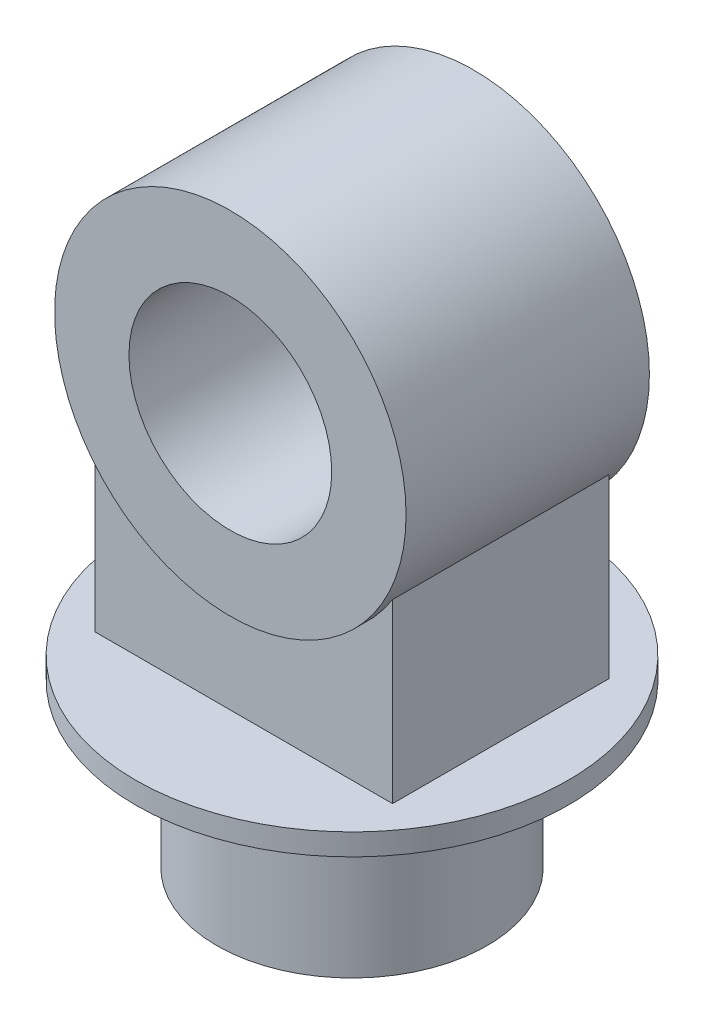
ISO-10303-21;
HEADER;
FILE_DESCRIPTION(('STEP AP214'),'2;1');
FILE_NAME('part.step','',(''),(''),'','','');
FILE_SCHEMA(('AUTOMOTIVE_DESIGN { 1 0 10303 214 1 1 1 1 }'));
ENDSEC;
DATA;
#1=APPLICATION_CONTEXT('core data for automotive mechanical design processes');
#2=APPLICATION_PROTOCOL_DEFINITION('international standard','automotive_design',2000,#1);
#3=PRODUCT_CONTEXT('',#1,'mechanical');
#4=PRODUCT('Part','Part','',(#3));
#5=PRODUCT_RELATED_PRODUCT_CATEGORY('part','',(#4));
#6=PRODUCT_DEFINITION_FORMATION('','',#4);
#7=PRODUCT_DEFINITION_CONTEXT('part definition',#1,'design');
#8=PRODUCT_DEFINITION('design','',#6,#7);
#9=PRODUCT_DEFINITION_SHAPE('','',#8);
#10=(LENGTH_UNIT() NAMED_UNIT(*) SI_UNIT(.MILLI.,.METRE.));
#11=(NAMED_UNIT(*) PLANE_ANGLE_UNIT() SI_UNIT($,.RADIAN.));
#12=(NAMED_UNIT(*) SI_UNIT($,.STERADIAN.) SOLID_ANGLE_UNIT());
#13=UNCERTAINTY_MEASURE_WITH_UNIT(LENGTH_MEASURE(1.E-05),#10,'distance_accuracy_value','');
#14=(GEOMETRIC_REPRESENTATION_CONTEXT(3) GLOBAL_UNCERTAINTY_ASSIGNED_CONTEXT((#13)) GLOBAL_UNIT_ASSIGNED_CONTEXT((#10,
#11,#12)) REPRESENTATION_CONTEXT('',''));
#15=CARTESIAN_POINT('',(0.,0.,0.));
#16=DIRECTION('',(0.,0.,1.));
#17=DIRECTION('',(1.,0.,0.));
#18=AXIS2_PLACEMENT_3D('',#15,#16,#17);
#19=CARTESIAN_POINT('',(0.,120.,0.));
#20=DIRECTION('',(0.,-1.,0.));
#21=DIRECTION('',(0.,0.,-1.));
#22=AXIS2_PLACEMENT_3D('',#19,#20,#21);
#23=CYLINDRICAL_SURFACE('',#22,100.);
#24=CARTESIAN_POINT('',(0.,120.,0.));
#25=DIRECTION('',(0.,1.,0.));
#26=DIRECTION('',(0.,0.,1.));
#27=AXIS2_PLACEMENT_3D('',#24,#25,#26);
#28=CIRCLE('',#27,100.);
#29=CARTESIAN_POINT('',(0.,120.,100.));
#30=VERTEX_POINT('',#29);
#31=EDGE_CURVE('E11',#30,#30,#28,.T.);
#32=ORIENTED_EDGE('',*,*,#31,.F.);
#33=EDGE_LOOP('',(#32));
#34=FACE_BOUND('',#33,.T.);
#35=CARTESIAN_POINT('',(0.,0.,0.));
#36=DIRECTION('',(0.,1.,0.));
#37=DIRECTION('',(0.,0.,1.));
#38=AXIS2_PLACEMENT_3D('',#35,#36,#37);
#39=CIRCLE('',#38,100.);
#40=CARTESIAN_POINT('',(0.,0.,100.));
#41=VERTEX_POINT('',#40);
#42=EDGE_CURVE('E46',#41,#41,#39,.T.);
#43=ORIENTED_EDGE('',*,*,#42,.T.);
#44=EDGE_LOOP('',(#43));
#45=FACE_BOUND('',#44,.T.);
#46=ADVANCED_FACE('F43',(#34,#45),#23,.T.);
#47=CARTESIAN_POINT('',(0.,0.,0.));
#48=DIRECTION('',(0.,1.,0.));
#49=DIRECTION('',(0.,0.,1.));
#50=AXIS2_PLACEMENT_3D('',#47,#48,#49);
#51=PLANE('',#50);
#52=ORIENTED_EDGE('',*,*,#42,.F.);
#53=EDGE_LOOP('',(#52));
#54=FACE_BOUND('',#53,.T.);
#55=ADVANCED_FACE('F163',(#54),#51,.F.);
#56=CARTESIAN_POINT('',(0.,136.,0.));
#57=DIRECTION('',(0.,-1.,0.));
#58=DIRECTION('',(0.,0.,-1.));
#59=AXIS2_PLACEMENT_3D('',#56,#57,#58);
#60=CYLINDRICAL_SURFACE('',#59,160.);
#61=CARTESIAN_POINT('',(0.,136.,0.));
#62=DIRECTION('',(0.,1.,0.));
#63=DIRECTION('',(0.,0.,1.));
#64=AXIS2_PLACEMENT_3D('',#61,#62,#63);
#65=CIRCLE('',#64,160.);
#66=CARTESIAN_POINT('',(0.,136.,160.));
#67=VERTEX_POINT('',#66);
#68=EDGE_CURVE('E110',#67,#67,#65,.T.);
#69=ORIENTED_EDGE('',*,*,#68,.F.);
#70=EDGE_LOOP('',(#69));
#71=FACE_BOUND('',#70,.T.);
#72=CARTESIAN_POINT('',(0.,120.,0.));
#73=DIRECTION('',(0.,1.,0.));
#74=DIRECTION('',(0.,0.,1.));
#75=AXIS2_PLACEMENT_3D('',#72,#73,#74);
#76=CIRCLE('',#75,160.);
#77=CARTESIAN_POINT('',(0.,120.,160.));
#78=VERTEX_POINT('',#77);
#79=EDGE_CURVE('E113',#78,#78,#76,.T.);
#80=ORIENTED_EDGE('',*,*,#79,.T.);
#81=EDGE_LOOP('',(#80));
#82=FACE_BOUND('',#81,.T.);
#83=ADVANCED_FACE('F168',(#71,#82),#60,.T.);
#84=CARTESIAN_POINT('',(0.,136.,0.));
#85=DIRECTION('',(0.,1.,0.));
#86=DIRECTION('',(0.,0.,1.));
#87=AXIS2_PLACEMENT_3D('',#84,#85,#86);
#88=PLANE('',#87);
#89=DIRECTION('',(0.,0.,-1.));
#90=VECTOR('',#89,1.);
#91=CARTESIAN_POINT('',(110.,136.,80.));
#92=LINE('',#91,#90);
#93=CARTESIAN_POINT('',(110.,136.,80.));
#94=VERTEX_POINT('',#93);
#95=CARTESIAN_POINT('',(110.,136.,-80.));
#96=VERTEX_POINT('',#95);
#97=EDGE_CURVE('E57',#94,#96,#92,.T.);
#98=ORIENTED_EDGE('',*,*,#97,.F.);
#99=DIRECTION('',(1.,0.,0.));
#100=VECTOR('',#99,1.);
#101=CARTESIAN_POINT('',(-110.,136.,80.));
#102=LINE('',#101,#100);
#103=CARTESIAN_POINT('',(-110.,136.,80.));
#104=VERTEX_POINT('',#103);
#105=EDGE_CURVE('E62',#104,#94,#102,.T.);
#106=ORIENTED_EDGE('',*,*,#105,.F.);
#107=DIRECTION('',(0.,0.,1.));
#108=VECTOR('',#107,1.);
#109=CARTESIAN_POINT('',(-110.,136.,80.));
#110=LINE('',#109,#108);
#111=CARTESIAN_POINT('',(-110.,136.,-80.));
#112=VERTEX_POINT('',#111);
#113=EDGE_CURVE('E120',#112,#104,#110,.T.);
#114=ORIENTED_EDGE('',*,*,#113,.F.);
#115=DIRECTION('',(-1.,0.,0.));
#116=VECTOR('',#115,1.);
#117=CARTESIAN_POINT('',(-110.,136.,-80.));
#118=LINE('',#117,#116);
#119=EDGE_CURVE('E117',#96,#112,#118,.T.);
#120=ORIENTED_EDGE('',*,*,#119,.F.);
#121=EDGE_LOOP('',(#98,#106,#114,#120));
#122=FACE_BOUND('',#121,.T.);
#123=ORIENTED_EDGE('',*,*,#68,.T.);
#124=EDGE_LOOP('',(#123));
#125=FACE_BOUND('',#124,.T.);
#126=ADVANCED_FACE('F178',(#122,#125),#88,.T.);
#127=CARTESIAN_POINT('',(0.,120.,0.));
#128=DIRECTION('',(0.,1.,0.));
#129=DIRECTION('',(0.,0.,1.));
#130=AXIS2_PLACEMENT_3D('',#127,#128,#129);
#131=PLANE('',#130);
#132=ORIENTED_EDGE('',*,*,#31,.T.);
#133=EDGE_LOOP('',(#132));
#134=FACE_BOUND('',#133,.T.);
#135=ORIENTED_EDGE('',*,*,#79,.F.);
#136=EDGE_LOOP('',(#135));
#137=FACE_BOUND('',#136,.T.);
#138=ADVANCED_FACE('F175',(#134,#137),#131,.F.);
#139=CARTESIAN_POINT('',(-110.,466.002,-80.));
#140=DIRECTION('',(0.,0.,1.));
#141=DIRECTION('',(1.,0.,0.));
#142=AXIS2_PLACEMENT_3D('',#139,#140,#141);
#143=PLANE('',#142);
#144=CARTESIAN_POINT('',(0.,336.,-80.));
#145=DIRECTION('',(0.,0.,1.));
#146=DIRECTION('',(1.,0.,0.));
#147=AXIS2_PLACEMENT_3D('',#144,#145,#146);
#148=CIRCLE('',#147,130.);
#149=CARTESIAN_POINT('',(110.,266.717967697245,-80.));
#150=VERTEX_POINT('',#149);
#151=CARTESIAN_POINT('',(-110.,266.717967697245,-80.));
#152=VERTEX_POINT('',#151);
#153=EDGE_CURVE('E97',#150,#152,#148,.F.);
#154=ORIENTED_EDGE('',*,*,#153,.F.);
#155=DIRECTION('',(0.,-1.,0.));
#156=VECTOR('',#155,1.);
#157=CARTESIAN_POINT('',(110.,466.002,-80.));
#158=LINE('',#157,#156);
#159=EDGE_CURVE('E94',#150,#96,#158,.T.);
#160=ORIENTED_EDGE('',*,*,#159,.T.);
#161=ORIENTED_EDGE('',*,*,#119,.T.);
#162=DIRECTION('',(0.,-1.,0.));
#163=VECTOR('',#162,1.);
#164=CARTESIAN_POINT('',(-110.,466.002,-80.));
#165=LINE('',#164,#163);
#166=EDGE_CURVE('E126',#152,#112,#165,.T.);
#167=ORIENTED_EDGE('',*,*,#166,.F.);
#168=EDGE_LOOP('',(#154,#160,#161,#167));
#169=FACE_BOUND('',#168,.T.);
#170=ADVANCED_FACE('F131',(#169),#143,.F.);
#171=CARTESIAN_POINT('',(110.,466.002,80.));
#172=DIRECTION('',(-1.,0.,0.));
#173=DIRECTION('',(0.,0.,1.));
#174=AXIS2_PLACEMENT_3D('',#171,#172,#173);
#175=PLANE('',#174);
#176=DIRECTION('',(0.,0.,-1.));
#177=VECTOR('',#176,1.);
#178=CARTESIAN_POINT('',(110.,266.717967697245,90.));
#179=LINE('',#178,#177);
#180=CARTESIAN_POINT('',(110.,266.717967697245,80.));
#181=VERTEX_POINT('',#180);
#182=EDGE_CURVE('E91',#181,#150,#179,.T.);
#183=ORIENTED_EDGE('',*,*,#182,.F.);
#184=DIRECTION('',(0.,-1.,0.));
#185=VECTOR('',#184,1.);
#186=CARTESIAN_POINT('',(110.,466.002,80.));
#187=LINE('',#186,#185);
#188=EDGE_CURVE('E80',#181,#94,#187,.T.);
#189=ORIENTED_EDGE('',*,*,#188,.T.);
#190=ORIENTED_EDGE('',*,*,#97,.T.);
#191=ORIENTED_EDGE('',*,*,#159,.F.);
#192=EDGE_LOOP('',(#183,#189,#190,#191));
#193=FACE_BOUND('',#192,.T.);
#194=ADVANCED_FACE('F92',(#193),#175,.F.);
#195=CARTESIAN_POINT('',(-110.,466.002,80.));
#196=DIRECTION('',(1.,0.,0.));
#197=DIRECTION('',(0.,0.,-1.));
#198=AXIS2_PLACEMENT_3D('',#195,#196,#197);
#199=PLANE('',#198);
#200=DIRECTION('',(0.,0.,-1.));
#201=VECTOR('',#200,1.);
#202=CARTESIAN_POINT('',(-110.,266.717967697245,90.));
#203=LINE('',#202,#201);
#204=CARTESIAN_POINT('',(-110.,266.717967697245,80.));
#205=VERTEX_POINT('',#204);
#206=EDGE_CURVE('E101',#152,#205,#203,.F.);
#207=ORIENTED_EDGE('',*,*,#206,.F.);
#208=ORIENTED_EDGE('',*,*,#166,.T.);
#209=ORIENTED_EDGE('',*,*,#113,.T.);
#210=DIRECTION('',(0.,-1.,0.));
#211=VECTOR('',#210,1.);
#212=CARTESIAN_POINT('',(-110.,466.002,80.));
#213=LINE('',#212,#211);
#214=EDGE_CURVE('E87',#205,#104,#213,.T.);
#215=ORIENTED_EDGE('',*,*,#214,.F.);
#216=EDGE_LOOP('',(#207,#208,#209,#215));
#217=FACE_BOUND('',#216,.T.);
#218=ADVANCED_FACE('F134',(#217),#199,.F.);
#219=CARTESIAN_POINT('',(-110.,466.002,80.));
#220=DIRECTION('',(0.,0.,-1.));
#221=DIRECTION('',(-1.,0.,0.));
#222=AXIS2_PLACEMENT_3D('',#219,#220,#221);
#223=PLANE('',#222);
#224=CARTESIAN_POINT('',(0.,336.,80.));
#225=DIRECTION('',(0.,0.,-1.));
#226=DIRECTION('',(-1.,0.,0.));
#227=AXIS2_PLACEMENT_3D('',#224,#225,#226);
#228=CIRCLE('',#227,130.);
#229=EDGE_CURVE('E84',#205,#181,#228,.F.);
#230=ORIENTED_EDGE('',*,*,#229,.F.);
#231=ORIENTED_EDGE('',*,*,#214,.T.);
#232=ORIENTED_EDGE('',*,*,#105,.T.);
#233=ORIENTED_EDGE('',*,*,#188,.F.);
#234=EDGE_LOOP('',(#230,#231,#232,#233));
#235=FACE_BOUND('',#234,.T.);
#236=ADVANCED_FACE('F82',(#235),#223,.F.);
#237=CARTESIAN_POINT('',(0.,336.,90.));
#238=DIRECTION('',(0.,0.,-1.));
#239=DIRECTION('',(-1.,0.,0.));
#240=AXIS2_PLACEMENT_3D('',#237,#238,#239);
#241=CYLINDRICAL_SURFACE('',#240,130.);
#242=CARTESIAN_POINT('',(0.,336.,90.));
#243=DIRECTION('',(0.,0.,1.));
#244=DIRECTION('',(1.,0.,0.));
#245=AXIS2_PLACEMENT_3D('',#242,#243,#244);
#246=CIRCLE('',#245,130.);
#247=CARTESIAN_POINT('',(130.,336.,90.));
#248=VERTEX_POINT('',#247);
#249=EDGE_CURVE('E102',#248,#248,#246,.T.);
#250=ORIENTED_EDGE('',*,*,#249,.F.);
#251=EDGE_LOOP('',(#250));
#252=FACE_BOUND('',#251,.T.);
#253=CARTESIAN_POINT('',(0.,336.,-90.));
#254=DIRECTION('',(0.,0.,1.));
#255=DIRECTION('',(1.,0.,0.));
#256=AXIS2_PLACEMENT_3D('',#253,#254,#255);
#257=CIRCLE('',#256,130.);
#258=CARTESIAN_POINT('',(130.,336.,-90.));
#259=VERTEX_POINT('',#258);
#260=EDGE_CURVE('E106',#259,#259,#257,.T.);
#261=ORIENTED_EDGE('',*,*,#260,.T.);
#262=EDGE_LOOP('',(#261));
#263=FACE_BOUND('',#262,.T.);
#264=ORIENTED_EDGE('',*,*,#182,.T.);
#265=ORIENTED_EDGE('',*,*,#153,.T.);
#266=ORIENTED_EDGE('',*,*,#206,.T.);
#267=ORIENTED_EDGE('',*,*,#229,.T.);
#268=EDGE_LOOP('',(#264,#265,#266,#267));
#269=FACE_BOUND('',#268,.T.);
#270=ADVANCED_FACE('F100',(#252,#263,#269),#241,.T.);
#271=CARTESIAN_POINT('',(0.,336.,90.));
#272=DIRECTION('',(0.,0.,1.));
#273=DIRECTION('',(1.,0.,0.));
#274=AXIS2_PLACEMENT_3D('',#271,#272,#273);
#275=PLANE('',#274);
#276=ORIENTED_EDGE('',*,*,#249,.T.);
#277=EDGE_LOOP('',(#276));
#278=FACE_BOUND('',#277,.T.);
#279=CARTESIAN_POINT('',(0.,336.,90.));
#280=DIRECTION('',(0.,0.,1.));
#281=DIRECTION('',(1.,0.,0.));
#282=AXIS2_PLACEMENT_3D('',#279,#280,#281);
#283=CIRCLE('',#282,75.);
#284=CARTESIAN_POINT('',(-75.,336.,90.));
#285=VERTEX_POINT('',#284);
#286=EDGE_CURVE('E137',#285,#285,#283,.T.);
#287=ORIENTED_EDGE('',*,*,#286,.F.);
#288=EDGE_LOOP('',(#287));
#289=FACE_BOUND('',#288,.T.);
#290=ADVANCED_FACE('F148',(#278,#289),#275,.T.);
#291=CARTESIAN_POINT('',(0.,336.,-90.));
#292=DIRECTION('',(0.,0.,1.));
#293=DIRECTION('',(1.,0.,0.));
#294=AXIS2_PLACEMENT_3D('',#291,#292,#293);
#295=PLANE('',#294);
#296=ORIENTED_EDGE('',*,*,#260,.F.);
#297=EDGE_LOOP('',(#296));
#298=FACE_BOUND('',#297,.T.);
#299=CARTESIAN_POINT('',(0.,336.,-90.));
#300=DIRECTION('',(0.,0.,1.));
#301=DIRECTION('',(1.,0.,0.));
#302=AXIS2_PLACEMENT_3D('',#299,#300,#301);
#303=CIRCLE('',#302,75.);
#304=CARTESIAN_POINT('',(-75.,336.,-90.));
#305=VERTEX_POINT('',#304);
#306=EDGE_CURVE('E139',#305,#305,#303,.T.);
#307=ORIENTED_EDGE('',*,*,#306,.T.);
#308=EDGE_LOOP('',(#307));
#309=FACE_BOUND('',#308,.T.);
#310=ADVANCED_FACE('F150',(#298,#309),#295,.F.);
#311=CARTESIAN_POINT('',(0.,336.,90.));
#312=DIRECTION('',(0.,0.,-1.));
#313=DIRECTION('',(-1.,0.,0.));
#314=AXIS2_PLACEMENT_3D('',#311,#312,#313);
#315=CYLINDRICAL_SURFACE('',#314,75.);
#316=CARTESIAN_POINT('',(-75.,336.,90.));
#317=CARTESIAN_POINT('',(-75.,336.,88.125));
#318=CARTESIAN_POINT('',(-75.,336.,86.25));
#319=CARTESIAN_POINT('',(-75.,336.,82.5));
#320=CARTESIAN_POINT('',(-75.,336.,80.625));
#321=CARTESIAN_POINT('',(-75.,336.,76.875));
#322=CARTESIAN_POINT('',(-75.,336.,75.));
#323=CARTESIAN_POINT('',(-75.,336.,71.25));
#324=CARTESIAN_POINT('',(-75.,336.,69.375));
#325=CARTESIAN_POINT('',(-75.,336.,65.625));
#326=CARTESIAN_POINT('',(-75.,336.,63.75));
#327=CARTESIAN_POINT('',(-75.,336.,60.));
#328=CARTESIAN_POINT('',(-75.,336.,58.125));
#329=CARTESIAN_POINT('',(-75.,336.,54.375));
#330=CARTESIAN_POINT('',(-75.,336.,52.5));
#331=CARTESIAN_POINT('',(-75.,336.,48.75));
#332=CARTESIAN_POINT('',(-75.,336.,46.875));
#333=CARTESIAN_POINT('',(-75.,336.,43.125));
#334=CARTESIAN_POINT('',(-75.,336.,41.25));
#335=CARTESIAN_POINT('',(-75.,336.,37.5));
#336=CARTESIAN_POINT('',(-75.,336.,35.625));
#337=CARTESIAN_POINT('',(-75.,336.,31.875));
#338=CARTESIAN_POINT('',(-75.,336.,30.));
#339=CARTESIAN_POINT('',(-75.,336.,26.25));
#340=CARTESIAN_POINT('',(-75.,336.,24.375));
#341=CARTESIAN_POINT('',(-75.,336.,20.625));
#342=CARTESIAN_POINT('',(-75.,336.,18.75));
#343=CARTESIAN_POINT('',(-75.,336.,15.));
#344=CARTESIAN_POINT('',(-75.,336.,13.125));
#345=CARTESIAN_POINT('',(-75.,336.,9.37499999999998));
#346=CARTESIAN_POINT('',(-75.,336.,7.49999999999998));
#347=CARTESIAN_POINT('',(-75.,336.,3.74999999999998));
#348=CARTESIAN_POINT('',(-75.,336.,1.87499999999997));
#349=CARTESIAN_POINT('',(-75.,336.,-1.87500000000003));
#350=CARTESIAN_POINT('',(-75.,336.,-3.75000000000003));
#351=CARTESIAN_POINT('',(-75.,336.,-7.50000000000003));
#352=CARTESIAN_POINT('',(-75.,336.,-9.37500000000004));
#353=CARTESIAN_POINT('',(-75.,336.,-13.125));
#354=CARTESIAN_POINT('',(-75.,336.,-15.));
#355=CARTESIAN_POINT('',(-75.,336.,-18.75));
#356=CARTESIAN_POINT('',(-75.,336.,-20.625));
#357=CARTESIAN_POINT('',(-75.,336.,-24.375));
#358=CARTESIAN_POINT('',(-75.,336.,-26.25));
#359=CARTESIAN_POINT('',(-75.,336.,-30.));
#360=CARTESIAN_POINT('',(-75.,336.,-31.875));
#361=CARTESIAN_POINT('',(-75.,336.,-35.625));
#362=CARTESIAN_POINT('',(-75.,336.,-37.5));
#363=CARTESIAN_POINT('',(-75.,336.,-41.25));
#364=CARTESIAN_POINT('',(-75.,336.,-43.125));
#365=CARTESIAN_POINT('',(-75.,336.,-46.875));
#366=CARTESIAN_POINT('',(-75.,336.,-48.75));
#367=CARTESIAN_POINT('',(-75.,336.,-52.5));
#368=CARTESIAN_POINT('',(-75.,336.,-54.375));
#369=CARTESIAN_POINT('',(-75.,336.,-58.125));
#370=CARTESIAN_POINT('',(-75.,336.,-60.));
#371=CARTESIAN_POINT('',(-75.,336.,-63.75));
#372=CARTESIAN_POINT('',(-75.,336.,-65.625));
#373=CARTESIAN_POINT('',(-75.,336.,-69.375));
#374=CARTESIAN_POINT('',(-75.,336.,-71.25));
#375=CARTESIAN_POINT('',(-75.,336.,-75.));
#376=CARTESIAN_POINT('',(-75.,336.,-76.875));
#377=CARTESIAN_POINT('',(-75.,336.,-80.625));
#378=CARTESIAN_POINT('',(-75.,336.,-82.5));
#379=CARTESIAN_POINT('',(-75.,336.,-86.25));
#380=CARTESIAN_POINT('',(-75.,336.,-88.125));
#381=CARTESIAN_POINT('',(-75.,336.,-90.));
#382=B_SPLINE_CURVE_WITH_KNOTS('',3,(#316,#317,#318,#319,#320,#321,#322,#323,#324,#325,#326,
#327,#328,#329,#330,#331,#332,#333,#334,#335,#336,#337,#338,#339,#340,#341,#342,#343,#344,#345,
#346,#347,#348,#349,#350,#351,#352,#353,#354,#355,#356,#357,#358,#359,#360,#361,#362,#363,#364,
#365,#366,#367,#368,#369,#370,#371,#372,#373,#374,#375,#376,#377,#378,#379,#380,#381),
.UNSPECIFIED.,.F.,.F.,(4,2,2,2,2,2,2,2,2,2,2,2,2,2,2,2,2,2,2,2,2,2,2,2,2,2,2,2,2,2,2,2,4),(0.,
5.62499999999999,11.25,16.875,22.5,28.125,33.75,39.375,45.,50.625,56.25,61.875,67.5,73.125,
78.75,84.375,90.,95.625,101.25,106.875,112.5,118.125,123.75,129.375,135.,140.625,146.25,151.875,
157.5,163.125,168.75,174.375,180.),.UNSPECIFIED.);
#383=EDGE_CURVE('BSEAM145',#285,#305,#382,.T.);
#384=ORIENTED_EDGE('',*,*,#286,.T.);
#385=ORIENTED_EDGE('',*,*,#306,.F.);
#386=ORIENTED_EDGE('',*,*,#383,.T.);
#387=ORIENTED_EDGE('',*,*,#383,.F.);
#388=EDGE_LOOP('',(#384,#386,#385,#387));
#389=FACE_BOUND('',#388,.T.);
#390=ADVANCED_FACE('F145',(#389),#315,.F.);
#391=CLOSED_SHELL('',(#46,#55,#83,#126,#138,#170,#194,#218,#236,#270,#290,#310,#390));
#392=MANIFOLD_SOLID_BREP('B2',#391);
#393=ADVANCED_BREP_SHAPE_REPRESENTATION('',(#18,#392),#14);
#394=SHAPE_DEFINITION_REPRESENTATION(#9,#393);
ENDSEC;
END-ISO-10303-21;
